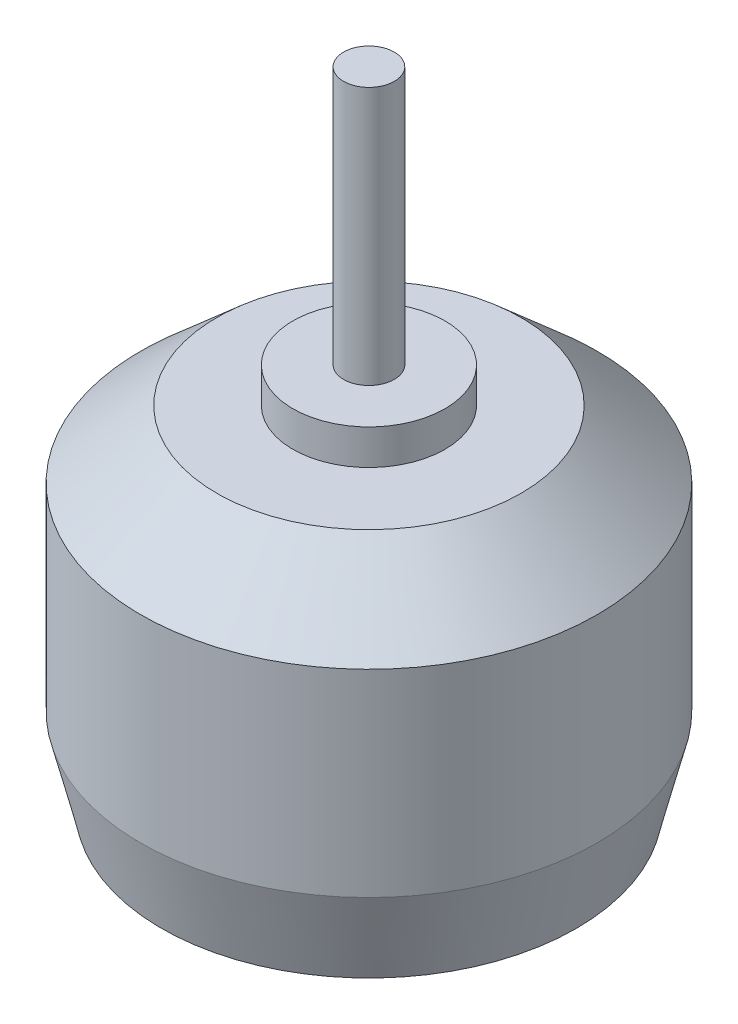
ISO-10303-21;
HEADER;
FILE_DESCRIPTION(('STEP AP214'),'2;1');
FILE_NAME('part.step','',(''),(''),'','','');
FILE_SCHEMA(('AUTOMOTIVE_DESIGN { 1 0 10303 214 1 1 1 1 }'));
ENDSEC;
DATA;
#1=APPLICATION_CONTEXT('core data for automotive mechanical design processes');
#2=APPLICATION_PROTOCOL_DEFINITION('international standard','automotive_design',2000,#1);
#3=PRODUCT_CONTEXT('',#1,'mechanical');
#4=PRODUCT('Part','Part','',(#3));
#5=PRODUCT_RELATED_PRODUCT_CATEGORY('part','',(#4));
#6=PRODUCT_DEFINITION_FORMATION('','',#4);
#7=PRODUCT_DEFINITION_CONTEXT('part definition',#1,'design');
#8=PRODUCT_DEFINITION('design','',#6,#7);
#9=PRODUCT_DEFINITION_SHAPE('','',#8);
#10=(LENGTH_UNIT() NAMED_UNIT(*) SI_UNIT(.MILLI.,.METRE.));
#11=(NAMED_UNIT(*) PLANE_ANGLE_UNIT() SI_UNIT($,.RADIAN.));
#12=(NAMED_UNIT(*) SI_UNIT($,.STERADIAN.) SOLID_ANGLE_UNIT());
#13=UNCERTAINTY_MEASURE_WITH_UNIT(LENGTH_MEASURE(1.E-05),#10,'distance_accuracy_value','');
#14=(GEOMETRIC_REPRESENTATION_CONTEXT(3) GLOBAL_UNCERTAINTY_ASSIGNED_CONTEXT((#13)) GLOBAL_UNIT_ASSIGNED_CONTEXT((#10,
#11,#12)) REPRESENTATION_CONTEXT('',''));
#15=CARTESIAN_POINT('',(0.,0.,0.));
#16=DIRECTION('',(0.,0.,1.));
#17=DIRECTION('',(1.,0.,0.));
#18=AXIS2_PLACEMENT_3D('',#15,#16,#17);
#19=CARTESIAN_POINT('',(0.,19.,0.));
#20=DIRECTION('',(0.,-1.,0.));
#21=DIRECTION('',(1.,0.,0.));
#22=AXIS2_PLACEMENT_3D('',#19,#20,#21);
#23=PLANE('',#22);
#24=CARTESIAN_POINT('',(0.,19.,0.));
#25=DIRECTION('',(0.,-1.,0.));
#26=DIRECTION('',(1.,0.,0.));
#27=AXIS2_PLACEMENT_3D('',#24,#25,#26);
#28=CIRCLE('',#27,1.5);
#29=CARTESIAN_POINT('',(1.49999999999999,19.,0.));
#30=VERTEX_POINT('',#29);
#31=EDGE_CURVE('E10',#30,#30,#28,.T.);
#32=ORIENTED_EDGE('',*,*,#31,.F.);
#33=EDGE_LOOP('',(#32));
#34=FACE_BOUND('',#33,.T.);
#35=ADVANCED_FACE('F37',(#34),#23,.F.);
#36=CARTESIAN_POINT('',(0.,-19.,0.));
#37=DIRECTION('',(0.,-1.,0.));
#38=DIRECTION('',(1.,0.,0.));
#39=AXIS2_PLACEMENT_3D('',#36,#37,#38);
#40=CYLINDRICAL_SURFACE('',#39,1.5);
#41=CARTESIAN_POINT('',(0.,3.73406696116635,0.));
#42=DIRECTION('',(0.,-1.,0.));
#43=DIRECTION('',(1.,0.,0.));
#44=AXIS2_PLACEMENT_3D('',#41,#42,#43);
#45=CIRCLE('',#44,1.5);
#46=CARTESIAN_POINT('',(1.5,3.73406696116635,0.));
#47=VERTEX_POINT('',#46);
#48=EDGE_CURVE('E45',#47,#47,#45,.T.);
#49=ORIENTED_EDGE('',*,*,#48,.F.);
#50=EDGE_LOOP('',(#49));
#51=FACE_BOUND('',#50,.T.);
#52=ORIENTED_EDGE('',*,*,#31,.T.);
#53=EDGE_LOOP('',(#52));
#54=FACE_BOUND('',#53,.T.);
#55=ADVANCED_FACE('F106',(#51,#54),#40,.T.);
#56=CARTESIAN_POINT('',(-1.50000000000001,3.73406696116635,0.));
#57=DIRECTION('',(0.,-1.,0.));
#58=DIRECTION('',(1.,0.,0.));
#59=AXIS2_PLACEMENT_3D('',#56,#57,#58);
#60=PLANE('',#59);
#61=CARTESIAN_POINT('',(0.,3.73406696116635,0.));
#62=DIRECTION('',(0.,-1.,0.));
#63=DIRECTION('',(1.,0.,0.));
#64=AXIS2_PLACEMENT_3D('',#61,#62,#63);
#65=CIRCLE('',#64,4.5);
#66=CARTESIAN_POINT('',(4.49999999999999,3.73406696116635,0.));
#67=VERTEX_POINT('',#66);
#68=EDGE_CURVE('E51',#67,#67,#65,.T.);
#69=ORIENTED_EDGE('',*,*,#68,.F.);
#70=EDGE_LOOP('',(#69));
#71=FACE_BOUND('',#70,.T.);
#72=ORIENTED_EDGE('',*,*,#48,.T.);
#73=EDGE_LOOP('',(#72));
#74=FACE_BOUND('',#73,.T.);
#75=ADVANCED_FACE('F103',(#71,#74),#60,.F.);
#76=CARTESIAN_POINT('',(0.,-19.,0.));
#77=DIRECTION('',(0.,-1.,0.));
#78=DIRECTION('',(1.,0.,0.));
#79=AXIS2_PLACEMENT_3D('',#76,#77,#78);
#80=CYLINDRICAL_SURFACE('',#79,4.5);
#81=CARTESIAN_POINT('',(0.,1.6547802764811,0.));
#82=DIRECTION('',(0.,-1.,0.));
#83=DIRECTION('',(1.,0.,0.));
#84=AXIS2_PLACEMENT_3D('',#81,#82,#83);
#85=CIRCLE('',#84,4.5);
#86=CARTESIAN_POINT('',(4.49999999999999,1.6547802764811,0.));
#87=VERTEX_POINT('',#86);
#88=EDGE_CURVE('E94',#87,#87,#85,.T.);
#89=ORIENTED_EDGE('',*,*,#88,.F.);
#90=EDGE_LOOP('',(#89));
#91=FACE_BOUND('',#90,.T.);
#92=ORIENTED_EDGE('',*,*,#68,.T.);
#93=EDGE_LOOP('',(#92));
#94=FACE_BOUND('',#93,.T.);
#95=ADVANCED_FACE('F101',(#91,#94),#80,.T.);
#96=CARTESIAN_POINT('',(-4.5,1.6547802764811,0.));
#97=DIRECTION('',(0.,-1.,0.));
#98=DIRECTION('',(1.,0.,0.));
#99=AXIS2_PLACEMENT_3D('',#96,#97,#98);
#100=PLANE('',#99);
#101=CARTESIAN_POINT('',(0.,1.6547802764811,0.));
#102=DIRECTION('',(0.,-1.,0.));
#103=DIRECTION('',(1.,0.,0.));
#104=AXIS2_PLACEMENT_3D('',#101,#102,#103);
#105=CIRCLE('',#104,9.);
#106=CARTESIAN_POINT('',(8.99999999999999,1.6547802764811,0.));
#107=VERTEX_POINT('',#106);
#108=EDGE_CURVE('E90',#107,#107,#105,.T.);
#109=ORIENTED_EDGE('',*,*,#108,.F.);
#110=EDGE_LOOP('',(#109));
#111=FACE_BOUND('',#110,.T.);
#112=ORIENTED_EDGE('',*,*,#88,.T.);
#113=EDGE_LOOP('',(#112));
#114=FACE_BOUND('',#113,.T.);
#115=ADVANCED_FACE('F118',(#111,#114),#100,.F.);
#116=CARTESIAN_POINT('',(0.,1.6547802764811,0.));
#117=DIRECTION('',(0.,-1.,0.));
#118=DIRECTION('',(1.,0.,0.));
#119=AXIS2_PLACEMENT_3D('',#116,#117,#118);
#120=CONICAL_SURFACE('',#119,9.,0.848062078981481);
#121=CARTESIAN_POINT('',(0.,-2.31384669011579,0.));
#122=DIRECTION('',(0.,-1.,0.));
#123=DIRECTION('',(1.,0.,0.));
#124=AXIS2_PLACEMENT_3D('',#121,#122,#123);
#125=CIRCLE('',#124,13.5);
#126=CARTESIAN_POINT('',(13.5,-2.31384669011578,0.));
#127=VERTEX_POINT('',#126);
#128=EDGE_CURVE('E81',#127,#127,#125,.T.);
#129=ORIENTED_EDGE('',*,*,#128,.F.);
#130=EDGE_LOOP('',(#129));
#131=FACE_BOUND('',#130,.T.);
#132=ORIENTED_EDGE('',*,*,#108,.T.);
#133=EDGE_LOOP('',(#132));
#134=FACE_BOUND('',#133,.T.);
#135=ADVANCED_FACE('F122',(#131,#134),#120,.T.);
#136=CARTESIAN_POINT('',(0.,-19.,0.));
#137=DIRECTION('',(0.,-1.,0.));
#138=DIRECTION('',(1.,0.,0.));
#139=AXIS2_PLACEMENT_3D('',#136,#137,#138);
#140=CYLINDRICAL_SURFACE('',#139,13.5);
#141=CARTESIAN_POINT('',(0.,-14.,0.));
#142=DIRECTION('',(0.,-1.,0.));
#143=DIRECTION('',(1.,0.,0.));
#144=AXIS2_PLACEMENT_3D('',#141,#142,#143);
#145=CIRCLE('',#144,13.5);
#146=CARTESIAN_POINT('',(13.5,-14.,0.));
#147=VERTEX_POINT('',#146);
#148=EDGE_CURVE('E75',#147,#147,#145,.T.);
#149=ORIENTED_EDGE('',*,*,#148,.F.);
#150=EDGE_LOOP('',(#149));
#151=FACE_BOUND('',#150,.T.);
#152=ORIENTED_EDGE('',*,*,#128,.T.);
#153=EDGE_LOOP('',(#152));
#154=FACE_BOUND('',#153,.T.);
#155=ADVANCED_FACE('F126',(#151,#154),#140,.T.);
#156=CARTESIAN_POINT('',(0.,-14.,0.));
#157=DIRECTION('',(0.,1.,0.));
#158=DIRECTION('',(-1.,0.,0.));
#159=AXIS2_PLACEMENT_3D('',#156,#157,#158);
#160=CONICAL_SURFACE('',#159,13.5,0.24232190911885);
#161=CARTESIAN_POINT('',(0.,-19.,0.));
#162=DIRECTION('',(0.,-1.,0.));
#163=DIRECTION('',(1.,0.,0.));
#164=AXIS2_PLACEMENT_3D('',#161,#162,#163);
#165=CIRCLE('',#164,12.2641046706927);
#166=CARTESIAN_POINT('',(12.2641046706927,-19.,0.));
#167=VERTEX_POINT('',#166);
#168=EDGE_CURVE('E70',#167,#167,#165,.T.);
#169=ORIENTED_EDGE('',*,*,#168,.F.);
#170=EDGE_LOOP('',(#169));
#171=FACE_BOUND('',#170,.T.);
#172=ORIENTED_EDGE('',*,*,#148,.T.);
#173=EDGE_LOOP('',(#172));
#174=FACE_BOUND('',#173,.T.);
#175=ADVANCED_FACE('F130',(#171,#174),#160,.T.);
#176=CARTESIAN_POINT('',(-12.2641046706927,-19.,0.));
#177=DIRECTION('',(0.,1.,0.));
#178=DIRECTION('',(-1.,0.,0.));
#179=AXIS2_PLACEMENT_3D('',#176,#177,#178);
#180=PLANE('',#179);
#181=CARTESIAN_POINT('',(-9.,-19.,0.));
#182=DIRECTION('',(0.,1.,0.));
#183=DIRECTION('',(-1.,0.,0.));
#184=AXIS2_PLACEMENT_3D('',#181,#182,#183);
#185=CIRCLE('',#184,1.25);
#186=CARTESIAN_POINT('',(-10.25,-19.,0.));
#187=VERTEX_POINT('',#186);
#188=EDGE_CURVE('E40',#187,#187,#185,.T.);
#189=ORIENTED_EDGE('',*,*,#188,.T.);
#190=EDGE_LOOP('',(#189));
#191=FACE_BOUND('',#190,.T.);
#192=CARTESIAN_POINT('',(9.,-19.,0.));
#193=DIRECTION('',(0.,1.,0.));
#194=DIRECTION('',(-1.,0.,0.));
#195=AXIS2_PLACEMENT_3D('',#192,#193,#194);
#196=CIRCLE('',#195,1.25);
#197=CARTESIAN_POINT('',(7.75,-19.,0.));
#198=VERTEX_POINT('',#197);
#199=EDGE_CURVE('E63',#198,#198,#196,.T.);
#200=ORIENTED_EDGE('',*,*,#199,.T.);
#201=EDGE_LOOP('',(#200));
#202=FACE_BOUND('',#201,.T.);
#203=CARTESIAN_POINT('',(0.,-19.,7.));
#204=DIRECTION('',(0.,1.,0.));
#205=DIRECTION('',(-1.,0.,0.));
#206=AXIS2_PLACEMENT_3D('',#203,#204,#205);
#207=CIRCLE('',#206,1.25);
#208=CARTESIAN_POINT('',(-1.25,-19.,7.));
#209=VERTEX_POINT('',#208);
#210=EDGE_CURVE('E59',#209,#209,#207,.T.);
#211=ORIENTED_EDGE('',*,*,#210,.T.);
#212=EDGE_LOOP('',(#211));
#213=FACE_BOUND('',#212,.T.);
#214=CARTESIAN_POINT('',(0.,-19.,-7.));
#215=DIRECTION('',(0.,1.,0.));
#216=DIRECTION('',(-1.,0.,0.));
#217=AXIS2_PLACEMENT_3D('',#214,#215,#216);
#218=CIRCLE('',#217,1.25);
#219=CARTESIAN_POINT('',(-1.25,-19.,-7.));
#220=VERTEX_POINT('',#219);
#221=EDGE_CURVE('E55',#220,#220,#218,.T.);
#222=ORIENTED_EDGE('',*,*,#221,.T.);
#223=EDGE_LOOP('',(#222));
#224=FACE_BOUND('',#223,.T.);
#225=ORIENTED_EDGE('',*,*,#168,.T.);
#226=EDGE_LOOP('',(#225));
#227=FACE_BOUND('',#226,.T.);
#228=ADVANCED_FACE('F134',(#191,#202,#213,#224,#227),#180,.F.);
#229=CARTESIAN_POINT('',(0.,-24.,-7.));
#230=DIRECTION('',(0.,1.,0.));
#231=DIRECTION('',(-1.,0.,0.));
#232=AXIS2_PLACEMENT_3D('',#229,#230,#231);
#233=CYLINDRICAL_SURFACE('',#232,1.25);
#234=CARTESIAN_POINT('',(0.,-14.,-7.));
#235=DIRECTION('',(0.,1.,0.));
#236=DIRECTION('',(1.,0.,0.));
#237=AXIS2_PLACEMENT_3D('',#234,#235,#236);
#238=CIRCLE('',#237,1.25);
#239=CARTESIAN_POINT('',(1.25,-14.,-7.));
#240=VERTEX_POINT('',#239);
#241=EDGE_CURVE('E84',#240,#240,#238,.T.);
#242=ORIENTED_EDGE('',*,*,#241,.T.);
#243=EDGE_LOOP('',(#242));
#244=FACE_BOUND('',#243,.T.);
#245=ORIENTED_EDGE('',*,*,#221,.F.);
#246=EDGE_LOOP('',(#245));
#247=FACE_BOUND('',#246,.T.);
#248=ADVANCED_FACE('F138',(#244,#247),#233,.F.);
#249=CARTESIAN_POINT('',(0.,-14.,-7.));
#250=DIRECTION('',(0.,-1.,0.));
#251=DIRECTION('',(1.,0.,0.));
#252=AXIS2_PLACEMENT_3D('',#249,#250,#251);
#253=PLANE('',#252);
#254=ORIENTED_EDGE('',*,*,#241,.F.);
#255=EDGE_LOOP('',(#254));
#256=FACE_BOUND('',#255,.T.);
#257=ADVANCED_FACE('F141',(#256),#253,.T.);
#258=CARTESIAN_POINT('',(0.,-24.,7.));
#259=DIRECTION('',(0.,1.,0.));
#260=DIRECTION('',(-1.,0.,0.));
#261=AXIS2_PLACEMENT_3D('',#258,#259,#260);
#262=CYLINDRICAL_SURFACE('',#261,1.25);
#263=CARTESIAN_POINT('',(0.,-14.,7.));
#264=DIRECTION('',(0.,1.,0.));
#265=DIRECTION('',(-1.,0.,0.));
#266=AXIS2_PLACEMENT_3D('',#263,#264,#265);
#267=CIRCLE('',#266,1.25);
#268=CARTESIAN_POINT('',(-1.25,-14.,7.));
#269=VERTEX_POINT('',#268);
#270=EDGE_CURVE('E178',#269,#269,#267,.T.);
#271=ORIENTED_EDGE('',*,*,#270,.T.);
#272=EDGE_LOOP('',(#271));
#273=FACE_BOUND('',#272,.T.);
#274=ORIENTED_EDGE('',*,*,#210,.F.);
#275=EDGE_LOOP('',(#274));
#276=FACE_BOUND('',#275,.T.);
#277=ADVANCED_FACE('F145',(#273,#276),#262,.F.);
#278=CARTESIAN_POINT('',(0.,-14.,7.));
#279=DIRECTION('',(0.,1.,0.));
#280=DIRECTION('',(-1.,0.,0.));
#281=AXIS2_PLACEMENT_3D('',#278,#279,#280);
#282=PLANE('',#281);
#283=ORIENTED_EDGE('',*,*,#270,.F.);
#284=EDGE_LOOP('',(#283));
#285=FACE_BOUND('',#284,.T.);
#286=ADVANCED_FACE('F149',(#285),#282,.F.);
#287=CARTESIAN_POINT('',(9.,-24.,0.));
#288=DIRECTION('',(0.,1.,0.));
#289=DIRECTION('',(-1.,0.,0.));
#290=AXIS2_PLACEMENT_3D('',#287,#288,#289);
#291=CYLINDRICAL_SURFACE('',#290,1.25);
#292=CARTESIAN_POINT('',(9.,-14.,0.));
#293=DIRECTION('',(0.,1.,0.));
#294=DIRECTION('',(1.,0.,0.));
#295=AXIS2_PLACEMENT_3D('',#292,#293,#294);
#296=CIRCLE('',#295,1.25);
#297=CARTESIAN_POINT('',(10.25,-14.,0.));
#298=VERTEX_POINT('',#297);
#299=EDGE_CURVE('E174',#298,#298,#296,.T.);
#300=ORIENTED_EDGE('',*,*,#299,.T.);
#301=EDGE_LOOP('',(#300));
#302=FACE_BOUND('',#301,.T.);
#303=ORIENTED_EDGE('',*,*,#199,.F.);
#304=EDGE_LOOP('',(#303));
#305=FACE_BOUND('',#304,.T.);
#306=ADVANCED_FACE('F153',(#302,#305),#291,.F.);
#307=CARTESIAN_POINT('',(9.,-14.,0.));
#308=DIRECTION('',(0.,-1.,0.));
#309=DIRECTION('',(1.,0.,0.));
#310=AXIS2_PLACEMENT_3D('',#307,#308,#309);
#311=PLANE('',#310);
#312=ORIENTED_EDGE('',*,*,#299,.F.);
#313=EDGE_LOOP('',(#312));
#314=FACE_BOUND('',#313,.T.);
#315=ADVANCED_FACE('F157',(#314),#311,.T.);
#316=CARTESIAN_POINT('',(-9.,-24.,0.));
#317=DIRECTION('',(0.,1.,0.));
#318=DIRECTION('',(-1.,0.,0.));
#319=AXIS2_PLACEMENT_3D('',#316,#317,#318);
#320=CYLINDRICAL_SURFACE('',#319,1.25);
#321=CARTESIAN_POINT('',(-9.,-14.,0.));
#322=DIRECTION('',(0.,1.,0.));
#323=DIRECTION('',(-1.,0.,0.));
#324=AXIS2_PLACEMENT_3D('',#321,#322,#323);
#325=CIRCLE('',#324,1.25);
#326=CARTESIAN_POINT('',(-10.25,-14.,0.));
#327=VERTEX_POINT('',#326);
#328=EDGE_CURVE('E60',#327,#327,#325,.T.);
#329=ORIENTED_EDGE('',*,*,#328,.T.);
#330=EDGE_LOOP('',(#329));
#331=FACE_BOUND('',#330,.T.);
#332=ORIENTED_EDGE('',*,*,#188,.F.);
#333=EDGE_LOOP('',(#332));
#334=FACE_BOUND('',#333,.T.);
#335=ADVANCED_FACE('F161',(#331,#334),#320,.F.);
#336=CARTESIAN_POINT('',(-9.,-14.,0.));
#337=DIRECTION('',(0.,1.,0.));
#338=DIRECTION('',(-1.,0.,0.));
#339=AXIS2_PLACEMENT_3D('',#336,#337,#338);
#340=PLANE('',#339);
#341=ORIENTED_EDGE('',*,*,#328,.F.);
#342=EDGE_LOOP('',(#341));
#343=FACE_BOUND('',#342,.T.);
#344=ADVANCED_FACE('F165',(#343),#340,.F.);
#345=CLOSED_SHELL('',(#35,#55,#75,#95,#115,#135,#155,#175,#228,#248,#257,#277,#286,#306,#315,
#335,#344));
#346=MANIFOLD_SOLID_BREP('B2',#345);
#347=ADVANCED_BREP_SHAPE_REPRESENTATION('',(#18,#346),#14);
#348=SHAPE_DEFINITION_REPRESENTATION(#9,#347);
ENDSEC;
END-ISO-10303-21;
